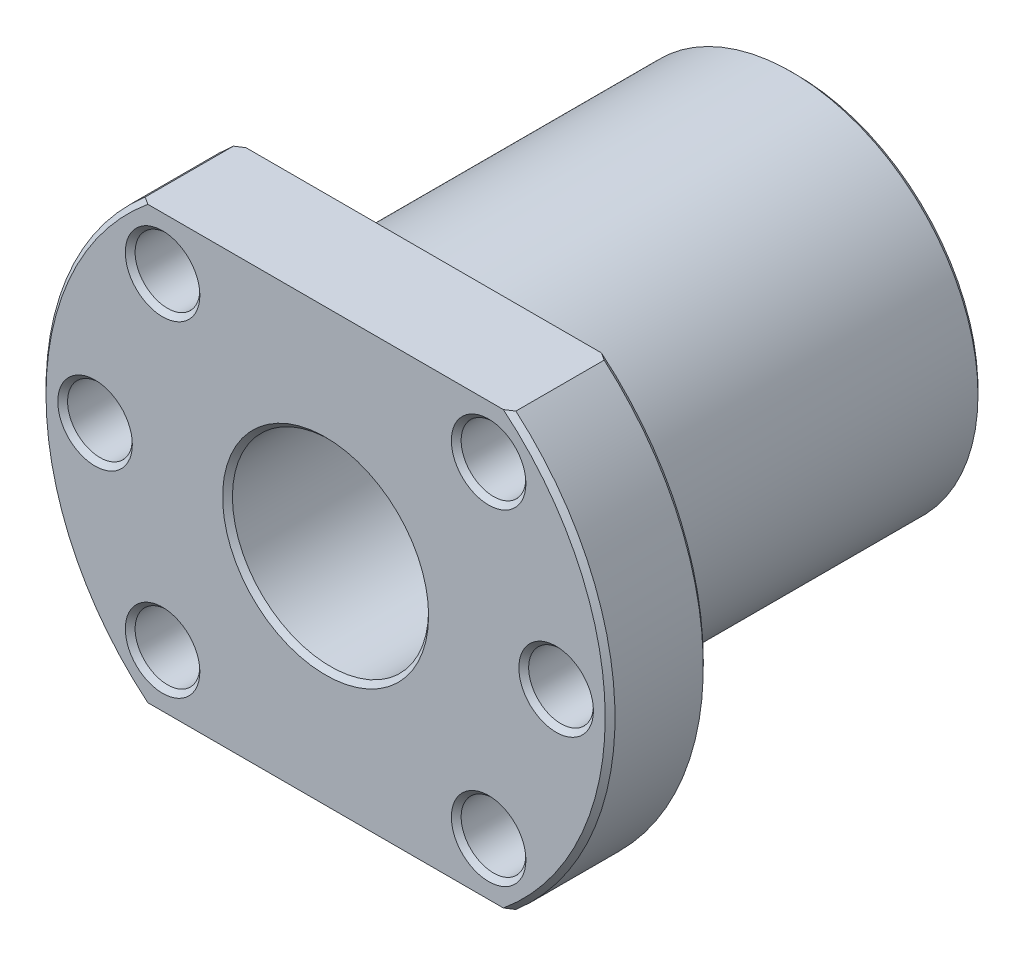
ISO-10303-21;
HEADER;
FILE_DESCRIPTION(('STEP AP214'),'2;1');
FILE_NAME('part.step','',(''),(''),'','','');
FILE_SCHEMA(('AUTOMOTIVE_DESIGN { 1 0 10303 214 1 1 1 1 }'));
ENDSEC;
DATA;
#1=APPLICATION_CONTEXT('core data for automotive mechanical design processes');
#2=APPLICATION_PROTOCOL_DEFINITION('international standard','automotive_design',2000,#1);
#3=PRODUCT_CONTEXT('',#1,'mechanical');
#4=PRODUCT('Part','Part','',(#3));
#5=PRODUCT_RELATED_PRODUCT_CATEGORY('part','',(#4));
#6=PRODUCT_DEFINITION_FORMATION('','',#4);
#7=PRODUCT_DEFINITION_CONTEXT('part definition',#1,'design');
#8=PRODUCT_DEFINITION('design','',#6,#7);
#9=PRODUCT_DEFINITION_SHAPE('','',#8);
#10=(LENGTH_UNIT() NAMED_UNIT(*) SI_UNIT(.MILLI.,.METRE.));
#11=(NAMED_UNIT(*) PLANE_ANGLE_UNIT() SI_UNIT($,.RADIAN.));
#12=(NAMED_UNIT(*) SI_UNIT($,.STERADIAN.) SOLID_ANGLE_UNIT());
#13=UNCERTAINTY_MEASURE_WITH_UNIT(LENGTH_MEASURE(1.E-05),#10,'distance_accuracy_value','');
#14=(GEOMETRIC_REPRESENTATION_CONTEXT(3) GLOBAL_UNCERTAINTY_ASSIGNED_CONTEXT((#13)) GLOBAL_UNIT_ASSIGNED_CONTEXT((#10,
#11,#12)) REPRESENTATION_CONTEXT('',''));
#15=CARTESIAN_POINT('',(0.,0.,0.));
#16=DIRECTION('',(0.,0.,1.));
#17=DIRECTION('',(1.,0.,0.));
#18=AXIS2_PLACEMENT_3D('',#15,#16,#17);
#19=CARTESIAN_POINT('',(0.,0.,0.));
#20=DIRECTION('',(0.,0.,1.));
#21=DIRECTION('',(1.,0.,0.));
#22=AXIS2_PLACEMENT_3D('',#19,#20,#21);
#23=PLANE('',#22);
#24=CARTESIAN_POINT('',(16.6170093578838,16.6170093578839,0.));
#25=DIRECTION('',(0.,0.,1.));
#26=DIRECTION('',(1.,0.,0.));
#27=AXIS2_PLACEMENT_3D('',#24,#25,#26);
#28=CIRCLE('',#27,3.8);
#29=CARTESIAN_POINT('',(20.4170093578838,16.6170093578839,0.));
#30=VERTEX_POINT('',#29);
#31=EDGE_CURVE('E312',#30,#30,#28,.T.);
#32=ORIENTED_EDGE('',*,*,#31,.T.);
#33=EDGE_LOOP('',(#32));
#34=FACE_BOUND('',#33,.T.);
#35=CARTESIAN_POINT('',(23.5,0.,0.));
#36=DIRECTION('',(0.,0.,1.));
#37=DIRECTION('',(1.,0.,0.));
#38=AXIS2_PLACEMENT_3D('',#35,#36,#37);
#39=CIRCLE('',#38,3.79999999999999);
#40=CARTESIAN_POINT('',(27.3,0.,0.));
#41=VERTEX_POINT('',#40);
#42=EDGE_CURVE('E308',#41,#41,#39,.T.);
#43=ORIENTED_EDGE('',*,*,#42,.T.);
#44=EDGE_LOOP('',(#43));
#45=FACE_BOUND('',#44,.T.);
#46=CARTESIAN_POINT('',(-16.617009357884,16.6170093578838,0.));
#47=DIRECTION('',(0.,0.,1.));
#48=DIRECTION('',(1.,0.,0.));
#49=AXIS2_PLACEMENT_3D('',#46,#47,#48);
#50=CIRCLE('',#49,3.79999999999999);
#51=CARTESIAN_POINT('',(-12.817009357884,16.6170093578838,0.));
#52=VERTEX_POINT('',#51);
#53=EDGE_CURVE('E304',#52,#52,#50,.T.);
#54=ORIENTED_EDGE('',*,*,#53,.T.);
#55=EDGE_LOOP('',(#54));
#56=FACE_BOUND('',#55,.T.);
#57=CARTESIAN_POINT('',(-23.5,0.,0.));
#58=DIRECTION('',(0.,0.,1.));
#59=DIRECTION('',(1.,0.,0.));
#60=AXIS2_PLACEMENT_3D('',#57,#58,#59);
#61=CIRCLE('',#60,3.80000000000001);
#62=CARTESIAN_POINT('',(-19.7,0.,0.));
#63=VERTEX_POINT('',#62);
#64=EDGE_CURVE('E300',#63,#63,#61,.T.);
#65=ORIENTED_EDGE('',*,*,#64,.T.);
#66=EDGE_LOOP('',(#65));
#67=FACE_BOUND('',#66,.T.);
#68=CARTESIAN_POINT('',(-16.617009357884,-16.6170093578838,0.));
#69=DIRECTION('',(0.,0.,1.));
#70=DIRECTION('',(1.,0.,0.));
#71=AXIS2_PLACEMENT_3D('',#68,#69,#70);
#72=CIRCLE('',#71,3.80000000000001);
#73=CARTESIAN_POINT('',(-12.8170093578839,-16.6170093578838,0.));
#74=VERTEX_POINT('',#73);
#75=EDGE_CURVE('E296',#74,#74,#72,.T.);
#76=ORIENTED_EDGE('',*,*,#75,.T.);
#77=EDGE_LOOP('',(#76));
#78=FACE_BOUND('',#77,.T.);
#79=CARTESIAN_POINT('',(16.6170093578841,-16.6170093578837,0.));
#80=DIRECTION('',(0.,0.,1.));
#81=DIRECTION('',(1.,0.,0.));
#82=AXIS2_PLACEMENT_3D('',#79,#80,#81);
#83=CIRCLE('',#82,3.8);
#84=CARTESIAN_POINT('',(20.4170093578841,-16.6170093578837,0.));
#85=VERTEX_POINT('',#84);
#86=EDGE_CURVE('E292',#85,#85,#83,.T.);
#87=ORIENTED_EDGE('',*,*,#86,.T.);
#88=EDGE_LOOP('',(#87));
#89=FACE_BOUND('',#88,.T.);
#90=DIRECTION('',(1.,0.,0.));
#91=VECTOR('',#90,1.);
#92=CARTESIAN_POINT('',(0.,-22.,0.));
#93=LINE('',#92,#91);
#94=CARTESIAN_POINT('',(-18.1176709319935,-22.,0.));
#95=VERTEX_POINT('',#94);
#96=CARTESIAN_POINT('',(18.1176709319935,-22.,0.));
#97=VERTEX_POINT('',#96);
#98=EDGE_CURVE('E244',#95,#97,#93,.T.);
#99=ORIENTED_EDGE('',*,*,#98,.F.);
#100=CARTESIAN_POINT('',(0.,0.,0.));
#101=DIRECTION('',(0.,0.,1.));
#102=DIRECTION('',(1.,0.,0.));
#103=AXIS2_PLACEMENT_3D('',#100,#101,#102);
#104=CIRCLE('',#103,28.5);
#105=CARTESIAN_POINT('',(-18.1176709319935,22.,0.));
#106=VERTEX_POINT('',#105);
#107=EDGE_CURVE('E235',#95,#106,#104,.F.);
#108=ORIENTED_EDGE('',*,*,#107,.T.);
#109=DIRECTION('',(-1.,0.,0.));
#110=VECTOR('',#109,1.);
#111=CARTESIAN_POINT('',(0.,22.,0.));
#112=LINE('',#111,#110);
#113=CARTESIAN_POINT('',(18.1176709319935,22.,0.));
#114=VERTEX_POINT('',#113);
#115=EDGE_CURVE('E251',#114,#106,#112,.T.);
#116=ORIENTED_EDGE('',*,*,#115,.F.);
#117=CARTESIAN_POINT('',(0.,0.,0.));
#118=DIRECTION('',(0.,0.,1.));
#119=DIRECTION('',(1.,0.,0.));
#120=AXIS2_PLACEMENT_3D('',#117,#118,#119);
#121=CIRCLE('',#120,28.5);
#122=EDGE_CURVE('E237',#114,#97,#121,.F.);
#123=ORIENTED_EDGE('',*,*,#122,.T.);
#124=EDGE_LOOP('',(#99,#108,#116,#123));
#125=FACE_BOUND('',#124,.T.);
#126=CARTESIAN_POINT('',(0.,0.,0.));
#127=DIRECTION('',(0.,0.,1.));
#128=DIRECTION('',(1.,0.,0.));
#129=AXIS2_PLACEMENT_3D('',#126,#127,#128);
#130=CIRCLE('',#129,19.);
#131=CARTESIAN_POINT('',(19.,0.,0.));
#132=VERTEX_POINT('',#131);
#133=EDGE_CURVE('E132',#132,#132,#130,.F.);
#134=ORIENTED_EDGE('',*,*,#133,.F.);
#135=EDGE_LOOP('',(#134));
#136=FACE_BOUND('',#135,.T.);
#137=ADVANCED_FACE('F41',(#34,#45,#56,#67,#78,#89,#125,#136),#23,.F.);
#138=CARTESIAN_POINT('',(0.,0.,10.));
#139=DIRECTION('',(0.,0.,1.));
#140=DIRECTION('',(1.,0.,0.));
#141=AXIS2_PLACEMENT_3D('',#138,#139,#140);
#142=PLANE('',#141);
#143=CARTESIAN_POINT('',(0.,0.,10.));
#144=DIRECTION('',(0.,0.,1.));
#145=DIRECTION('',(1.,0.,0.));
#146=AXIS2_PLACEMENT_3D('',#143,#144,#145);
#147=CIRCLE('',#146,10.5);
#148=CARTESIAN_POINT('',(10.5,0.,10.));
#149=VERTEX_POINT('',#148);
#150=EDGE_CURVE('E263',#149,#149,#147,.F.);
#151=ORIENTED_EDGE('',*,*,#150,.T.);
#152=EDGE_LOOP('',(#151));
#153=FACE_BOUND('',#152,.T.);
#154=CARTESIAN_POINT('',(23.5,0.,10.));
#155=DIRECTION('',(0.,0.,1.));
#156=DIRECTION('',(1.,0.,0.));
#157=AXIS2_PLACEMENT_3D('',#154,#155,#156);
#158=CIRCLE('',#157,3.8);
#159=CARTESIAN_POINT('',(27.3,0.,10.));
#160=VERTEX_POINT('',#159);
#161=EDGE_CURVE('E384',#160,#160,#158,.F.);
#162=ORIENTED_EDGE('',*,*,#161,.T.);
#163=EDGE_LOOP('',(#162));
#164=FACE_BOUND('',#163,.T.);
#165=CARTESIAN_POINT('',(16.6170093578841,-16.6170093578837,10.));
#166=DIRECTION('',(0.,0.,1.));
#167=DIRECTION('',(1.,0.,0.));
#168=AXIS2_PLACEMENT_3D('',#165,#166,#167);
#169=CIRCLE('',#168,3.8);
#170=CARTESIAN_POINT('',(20.4170093578841,-16.6170093578837,10.));
#171=VERTEX_POINT('',#170);
#172=EDGE_CURVE('E380',#171,#171,#169,.F.);
#173=ORIENTED_EDGE('',*,*,#172,.T.);
#174=EDGE_LOOP('',(#173));
#175=FACE_BOUND('',#174,.T.);
#176=CARTESIAN_POINT('',(-16.617009357884,-16.6170093578838,10.));
#177=DIRECTION('',(0.,0.,1.));
#178=DIRECTION('',(1.,0.,0.));
#179=AXIS2_PLACEMENT_3D('',#176,#177,#178);
#180=CIRCLE('',#179,3.8);
#181=CARTESIAN_POINT('',(-12.8170093578839,-16.6170093578838,10.));
#182=VERTEX_POINT('',#181);
#183=EDGE_CURVE('E376',#182,#182,#180,.F.);
#184=ORIENTED_EDGE('',*,*,#183,.T.);
#185=EDGE_LOOP('',(#184));
#186=FACE_BOUND('',#185,.T.);
#187=CARTESIAN_POINT('',(-23.5,0.,10.));
#188=DIRECTION('',(0.,0.,1.));
#189=DIRECTION('',(1.,0.,0.));
#190=AXIS2_PLACEMENT_3D('',#187,#188,#189);
#191=CIRCLE('',#190,3.8);
#192=CARTESIAN_POINT('',(-19.7,0.,10.));
#193=VERTEX_POINT('',#192);
#194=EDGE_CURVE('E372',#193,#193,#191,.F.);
#195=ORIENTED_EDGE('',*,*,#194,.T.);
#196=EDGE_LOOP('',(#195));
#197=FACE_BOUND('',#196,.T.);
#198=CARTESIAN_POINT('',(-16.617009357884,16.6170093578838,10.));
#199=DIRECTION('',(0.,0.,1.));
#200=DIRECTION('',(1.,0.,0.));
#201=AXIS2_PLACEMENT_3D('',#198,#199,#200);
#202=CIRCLE('',#201,3.8);
#203=CARTESIAN_POINT('',(-12.8170093578839,16.6170093578838,10.));
#204=VERTEX_POINT('',#203);
#205=EDGE_CURVE('E368',#204,#204,#202,.F.);
#206=ORIENTED_EDGE('',*,*,#205,.T.);
#207=EDGE_LOOP('',(#206));
#208=FACE_BOUND('',#207,.T.);
#209=CARTESIAN_POINT('',(16.6170093578838,16.6170093578839,10.));
#210=DIRECTION('',(0.,0.,1.));
#211=DIRECTION('',(1.,0.,0.));
#212=AXIS2_PLACEMENT_3D('',#209,#210,#211);
#213=CIRCLE('',#212,3.8);
#214=CARTESIAN_POINT('',(20.4170093578838,16.6170093578839,10.));
#215=VERTEX_POINT('',#214);
#216=EDGE_CURVE('E364',#215,#215,#213,.F.);
#217=ORIENTED_EDGE('',*,*,#216,.T.);
#218=EDGE_LOOP('',(#217));
#219=FACE_BOUND('',#218,.T.);
#220=DIRECTION('',(1.,0.,0.));
#221=VECTOR('',#220,1.);
#222=CARTESIAN_POINT('',(0.,-22.,10.));
#223=LINE('',#222,#221);
#224=CARTESIAN_POINT('',(-18.1176709319935,-22.,10.));
#225=VERTEX_POINT('',#224);
#226=CARTESIAN_POINT('',(18.1176709319935,-22.,10.));
#227=VERTEX_POINT('',#226);
#228=EDGE_CURVE('E115',#225,#227,#223,.T.);
#229=ORIENTED_EDGE('',*,*,#228,.T.);
#230=CARTESIAN_POINT('',(0.,0.,10.));
#231=DIRECTION('',(0.,0.,1.));
#232=DIRECTION('',(1.,0.,0.));
#233=AXIS2_PLACEMENT_3D('',#230,#231,#232);
#234=CIRCLE('',#233,28.5);
#235=CARTESIAN_POINT('',(18.1176709319935,22.,10.));
#236=VERTEX_POINT('',#235);
#237=EDGE_CURVE('E11',#227,#236,#234,.T.);
#238=ORIENTED_EDGE('',*,*,#237,.T.);
#239=DIRECTION('',(-1.,0.,0.));
#240=VECTOR('',#239,1.);
#241=CARTESIAN_POINT('',(0.,22.,10.));
#242=LINE('',#241,#240);
#243=CARTESIAN_POINT('',(-18.1176709319935,22.,10.));
#244=VERTEX_POINT('',#243);
#245=EDGE_CURVE('E273',#236,#244,#242,.T.);
#246=ORIENTED_EDGE('',*,*,#245,.T.);
#247=CARTESIAN_POINT('',(0.,0.,10.));
#248=DIRECTION('',(0.,0.,1.));
#249=DIRECTION('',(1.,0.,0.));
#250=AXIS2_PLACEMENT_3D('',#247,#248,#249);
#251=CIRCLE('',#250,28.5);
#252=EDGE_CURVE('E51',#244,#225,#251,.T.);
#253=ORIENTED_EDGE('',*,*,#252,.T.);
#254=EDGE_LOOP('',(#229,#238,#246,#253));
#255=FACE_BOUND('',#254,.T.);
#256=ADVANCED_FACE('F271',(#153,#164,#175,#186,#197,#208,#219,#255),#142,.T.);
#257=CARTESIAN_POINT('',(0.,0.,10.));
#258=DIRECTION('',(0.,0.,-1.));
#259=DIRECTION('',(-1.,0.,0.));
#260=AXIS2_PLACEMENT_3D('',#257,#258,#259);
#261=CYLINDRICAL_SURFACE('',#260,29.);
#262=DIRECTION('',(0.,0.,-1.));
#263=VECTOR('',#262,1.);
#264=CARTESIAN_POINT('',(-18.8944436276912,22.,10.));
#265=LINE('',#264,#263);
#266=CARTESIAN_POINT('',(-18.8944436276912,22.,9.49999999999999));
#267=VERTEX_POINT('',#266);
#268=CARTESIAN_POINT('',(-18.8944436276912,22.,0.499999999999997));
#269=VERTEX_POINT('',#268);
#270=EDGE_CURVE('E275',#267,#269,#265,.T.);
#271=ORIENTED_EDGE('',*,*,#270,.T.);
#272=CARTESIAN_POINT('',(0.,0.,0.499999999999997));
#273=DIRECTION('',(0.,0.,1.));
#274=DIRECTION('',(1.,0.,0.));
#275=AXIS2_PLACEMENT_3D('',#272,#273,#274);
#276=CIRCLE('',#275,29.);
#277=CARTESIAN_POINT('',(-18.8944436276912,-22.,0.499999999999997));
#278=VERTEX_POINT('',#277);
#279=EDGE_CURVE('E122',#269,#278,#276,.T.);
#280=ORIENTED_EDGE('',*,*,#279,.T.);
#281=DIRECTION('',(0.,0.,-1.));
#282=VECTOR('',#281,1.);
#283=CARTESIAN_POINT('',(-18.8944436276912,-22.,10.));
#284=LINE('',#283,#282);
#285=CARTESIAN_POINT('',(-18.8944436276912,-22.,9.49999999999999));
#286=VERTEX_POINT('',#285);
#287=EDGE_CURVE('E113',#286,#278,#284,.T.);
#288=ORIENTED_EDGE('',*,*,#287,.F.);
#289=CARTESIAN_POINT('',(0.,0.,9.49999999999999));
#290=DIRECTION('',(0.,0.,1.));
#291=DIRECTION('',(1.,0.,0.));
#292=AXIS2_PLACEMENT_3D('',#289,#290,#291);
#293=CIRCLE('',#292,29.);
#294=EDGE_CURVE('E128',#286,#267,#293,.F.);
#295=ORIENTED_EDGE('',*,*,#294,.T.);
#296=EDGE_LOOP('',(#271,#280,#288,#295));
#297=FACE_BOUND('',#296,.T.);
#298=ADVANCED_FACE('F127',(#297),#261,.T.);
#299=CARTESIAN_POINT('',(0.,-22.,10.));
#300=DIRECTION('',(0.,1.,0.));
#301=DIRECTION('',(0.,0.,1.));
#302=AXIS2_PLACEMENT_3D('',#299,#300,#301);
#303=PLANE('',#302);
#304=ORIENTED_EDGE('',*,*,#287,.T.);
#305=CARTESIAN_POINT('',(-18.8944436276912,-22.,0.499999999999997));
#306=CARTESIAN_POINT('',(-18.7654476909824,-22.,0.415942455408086));
#307=CARTESIAN_POINT('',(-18.6362186690729,-22.,0.332247019255507));
#308=CARTESIAN_POINT('',(-18.3772944372371,-22.,0.165580352490301));
#309=CARTESIAN_POINT('',(-18.2475992272474,-22.,0.0826091219762153));
#310=CARTESIAN_POINT('',(-18.1176709319935,-22.,0.));
#311=B_SPLINE_CURVE_WITH_KNOTS('',3,(#305,#306,#307,#308,#309,#310),.UNSPECIFIED.,.F.,.F.,(4,2,
4),(0.,0.461893489051494,0.923787040950301),.UNSPECIFIED.);
#312=EDGE_CURVE('E180',#278,#95,#311,.T.);
#313=ORIENTED_EDGE('',*,*,#312,.T.);
#314=ORIENTED_EDGE('',*,*,#98,.T.);
#315=CARTESIAN_POINT('',(18.1176709319935,-22.,0.));
#316=CARTESIAN_POINT('',(18.2475992272474,-22.,0.0826091219762149));
#317=CARTESIAN_POINT('',(18.3772944372371,-22.,0.165580352490301));
#318=CARTESIAN_POINT('',(18.6362186690729,-22.,0.332247019255507));
#319=CARTESIAN_POINT('',(18.7654476909824,-22.,0.415942455408087));
#320=CARTESIAN_POINT('',(18.8944436276912,-22.,0.499999999999998));
#321=B_SPLINE_CURVE_WITH_KNOTS('',3,(#315,#316,#317,#318,#319,#320),.UNSPECIFIED.,.F.,.F.,(4,2,
4),(0.,0.461893551898807,0.923787040950302),.UNSPECIFIED.);
#322=CARTESIAN_POINT('',(18.8944436276912,-22.,0.499999999999997));
#323=VERTEX_POINT('',#322);
#324=EDGE_CURVE('E173',#97,#323,#321,.T.);
#325=ORIENTED_EDGE('',*,*,#324,.T.);
#326=DIRECTION('',(0.,0.,-1.));
#327=VECTOR('',#326,1.);
#328=CARTESIAN_POINT('',(18.8944436276912,-22.,10.));
#329=LINE('',#328,#327);
#330=CARTESIAN_POINT('',(18.8944436276912,-22.,9.49999999999999));
#331=VERTEX_POINT('',#330);
#332=EDGE_CURVE('E133',#331,#323,#329,.T.);
#333=ORIENTED_EDGE('',*,*,#332,.F.);
#334=CARTESIAN_POINT('',(18.8944436276912,-22.,9.49999999999999));
#335=CARTESIAN_POINT('',(18.7654476909824,-22.,9.5840575445919));
#336=CARTESIAN_POINT('',(18.6362186690729,-22.,9.66775298074448));
#337=CARTESIAN_POINT('',(18.3772944372371,-22.,9.83441964750969));
#338=CARTESIAN_POINT('',(18.2475992272474,-22.,9.91739087802378));
#339=CARTESIAN_POINT('',(18.1176709319935,-22.,10.));
#340=B_SPLINE_CURVE_WITH_KNOTS('',3,(#334,#335,#336,#337,#338,#339),.UNSPECIFIED.,.F.,.F.,(4,2,
4),(0.,0.461893489051501,0.923787040950309),.UNSPECIFIED.);
#341=EDGE_CURVE('E121',#331,#227,#340,.T.);
#342=ORIENTED_EDGE('',*,*,#341,.T.);
#343=ORIENTED_EDGE('',*,*,#228,.F.);
#344=CARTESIAN_POINT('',(-18.1176709319935,-22.,10.));
#345=CARTESIAN_POINT('',(-18.2475992272474,-22.,9.91739087802378));
#346=CARTESIAN_POINT('',(-18.3772944372371,-22.,9.83441964750969));
#347=CARTESIAN_POINT('',(-18.6362186690729,-22.,9.66775298074448));
#348=CARTESIAN_POINT('',(-18.7654476909824,-22.,9.5840575445919));
#349=CARTESIAN_POINT('',(-18.8944436276912,-22.,9.49999999999999));
#350=B_SPLINE_CURVE_WITH_KNOTS('',3,(#344,#345,#346,#347,#348,#349),.UNSPECIFIED.,.F.,.F.,(4,2,
4),(0.,0.461893551898808,0.923787040950309),.UNSPECIFIED.);
#351=EDGE_CURVE('E110',#225,#286,#350,.T.);
#352=ORIENTED_EDGE('',*,*,#351,.T.);
#353=EDGE_LOOP('',(#304,#313,#314,#325,#333,#342,#343,#352));
#354=FACE_BOUND('',#353,.T.);
#355=ADVANCED_FACE('F112',(#354),#303,.F.);
#356=CARTESIAN_POINT('',(0.,0.,10.));
#357=DIRECTION('',(0.,0.,-1.));
#358=DIRECTION('',(-1.,0.,0.));
#359=AXIS2_PLACEMENT_3D('',#356,#357,#358);
#360=CYLINDRICAL_SURFACE('',#359,29.);
#361=ORIENTED_EDGE('',*,*,#332,.T.);
#362=CARTESIAN_POINT('',(0.,0.,0.499999999999997));
#363=DIRECTION('',(0.,0.,1.));
#364=DIRECTION('',(1.,0.,0.));
#365=AXIS2_PLACEMENT_3D('',#362,#363,#364);
#366=CIRCLE('',#365,29.);
#367=CARTESIAN_POINT('',(18.8944436276912,22.,0.499999999999997));
#368=VERTEX_POINT('',#367);
#369=EDGE_CURVE('E257',#323,#368,#366,.T.);
#370=ORIENTED_EDGE('',*,*,#369,.T.);
#371=DIRECTION('',(0.,0.,-1.));
#372=VECTOR('',#371,1.);
#373=CARTESIAN_POINT('',(18.8944436276912,22.,10.));
#374=LINE('',#373,#372);
#375=CARTESIAN_POINT('',(18.8944436276912,22.,9.49999999999999));
#376=VERTEX_POINT('',#375);
#377=EDGE_CURVE('E279',#376,#368,#374,.T.);
#378=ORIENTED_EDGE('',*,*,#377,.F.);
#379=CARTESIAN_POINT('',(0.,0.,9.49999999999999));
#380=DIRECTION('',(0.,0.,1.));
#381=DIRECTION('',(1.,0.,0.));
#382=AXIS2_PLACEMENT_3D('',#379,#380,#381);
#383=CIRCLE('',#382,29.);
#384=EDGE_CURVE('E255',#376,#331,#383,.F.);
#385=ORIENTED_EDGE('',*,*,#384,.T.);
#386=EDGE_LOOP('',(#361,#370,#378,#385));
#387=FACE_BOUND('',#386,.T.);
#388=ADVANCED_FACE('F166',(#387),#360,.T.);
#389=CARTESIAN_POINT('',(0.,22.,10.));
#390=DIRECTION('',(0.,-1.,0.));
#391=DIRECTION('',(0.,0.,-1.));
#392=AXIS2_PLACEMENT_3D('',#389,#390,#391);
#393=PLANE('',#392);
#394=ORIENTED_EDGE('',*,*,#115,.T.);
#395=CARTESIAN_POINT('',(-18.1176709319935,22.,0.));
#396=CARTESIAN_POINT('',(-18.2475992272474,22.,0.0826091219762149));
#397=CARTESIAN_POINT('',(-18.3772944372371,22.,0.165580352490301));
#398=CARTESIAN_POINT('',(-18.6362186690729,22.,0.332247019255507));
#399=CARTESIAN_POINT('',(-18.7654476909824,22.,0.415942455408087));
#400=CARTESIAN_POINT('',(-18.8944436276912,22.,0.499999999999998));
#401=B_SPLINE_CURVE_WITH_KNOTS('',3,(#395,#396,#397,#398,#399,#400),.UNSPECIFIED.,.F.,.F.,(4,2,
4),(0.,0.461893551898807,0.923787040950302),.UNSPECIFIED.);
#402=EDGE_CURVE('E209',#106,#269,#401,.T.);
#403=ORIENTED_EDGE('',*,*,#402,.T.);
#404=ORIENTED_EDGE('',*,*,#270,.F.);
#405=CARTESIAN_POINT('',(-18.8944436276912,22.,9.49999999999999));
#406=CARTESIAN_POINT('',(-18.7654476909824,22.,9.5840575445919));
#407=CARTESIAN_POINT('',(-18.6362186690729,22.,9.66775298074448));
#408=CARTESIAN_POINT('',(-18.3772944372371,22.,9.83441964750969));
#409=CARTESIAN_POINT('',(-18.2475992272474,22.,9.91739087802378));
#410=CARTESIAN_POINT('',(-18.1176709319935,22.,10.));
#411=B_SPLINE_CURVE_WITH_KNOTS('',3,(#405,#406,#407,#408,#409,#410),.UNSPECIFIED.,.F.,.F.,(4,2,
4),(0.,0.461893489051501,0.923787040950309),.UNSPECIFIED.);
#412=EDGE_CURVE('E137',#267,#244,#411,.T.);
#413=ORIENTED_EDGE('',*,*,#412,.T.);
#414=ORIENTED_EDGE('',*,*,#245,.F.);
#415=CARTESIAN_POINT('',(18.1176709319935,22.,10.));
#416=CARTESIAN_POINT('',(18.2475992272474,22.,9.91739087802378));
#417=CARTESIAN_POINT('',(18.3772944372371,22.,9.83441964750969));
#418=CARTESIAN_POINT('',(18.6362186690729,22.,9.66775298074448));
#419=CARTESIAN_POINT('',(18.7654476909824,22.,9.5840575445919));
#420=CARTESIAN_POINT('',(18.8944436276912,22.,9.49999999999999));
#421=B_SPLINE_CURVE_WITH_KNOTS('',3,(#415,#416,#417,#418,#419,#420),.UNSPECIFIED.,.F.,.F.,(4,2,
4),(0.,0.461893551898808,0.923787040950309),.UNSPECIFIED.);
#422=EDGE_CURVE('E66',#236,#376,#421,.T.);
#423=ORIENTED_EDGE('',*,*,#422,.T.);
#424=ORIENTED_EDGE('',*,*,#377,.T.);
#425=CARTESIAN_POINT('',(18.8944436276912,22.,0.499999999999997));
#426=CARTESIAN_POINT('',(18.7654476909824,22.,0.415942455408087));
#427=CARTESIAN_POINT('',(18.6362186690729,22.,0.332247019255508));
#428=CARTESIAN_POINT('',(18.3772944372371,22.,0.165580352490301));
#429=CARTESIAN_POINT('',(18.2475992272474,22.,0.0826091219762145));
#430=CARTESIAN_POINT('',(18.1176709319935,22.,0.));
#431=B_SPLINE_CURVE_WITH_KNOTS('',3,(#425,#426,#427,#428,#429,#430),.UNSPECIFIED.,.F.,.F.,(4,2,
4),(0.,0.461893489051497,0.923787040950303),.UNSPECIFIED.);
#432=EDGE_CURVE('E58',#368,#114,#431,.T.);
#433=ORIENTED_EDGE('',*,*,#432,.T.);
#434=EDGE_LOOP('',(#394,#403,#404,#413,#414,#423,#424,#433));
#435=FACE_BOUND('',#434,.T.);
#436=ADVANCED_FACE('F220',(#435),#393,.F.);
#437=CARTESIAN_POINT('',(0.,0.,10.));
#438=DIRECTION('',(0.,0.,-1.));
#439=DIRECTION('',(-1.,0.,0.));
#440=AXIS2_PLACEMENT_3D('',#437,#438,#439);
#441=CYLINDRICAL_SURFACE('',#440,10.);
#442=CARTESIAN_POINT('',(0.,0.,-37.5));
#443=DIRECTION('',(0.,0.,-1.));
#444=DIRECTION('',(-1.,0.,0.));
#445=AXIS2_PLACEMENT_3D('',#442,#443,#444);
#446=CIRCLE('',#445,10.);
#447=CARTESIAN_POINT('',(-10.,0.,-37.5));
#448=VERTEX_POINT('',#447);
#449=EDGE_CURVE('E139',#448,#448,#446,.T.);
#450=ORIENTED_EDGE('',*,*,#449,.T.);
#451=EDGE_LOOP('',(#450));
#452=FACE_BOUND('',#451,.T.);
#453=CARTESIAN_POINT('',(0.,0.,9.49999999999999));
#454=DIRECTION('',(0.,0.,1.));
#455=DIRECTION('',(1.,0.,0.));
#456=AXIS2_PLACEMENT_3D('',#453,#454,#455);
#457=CIRCLE('',#456,10.);
#458=CARTESIAN_POINT('',(10.,0.,9.49999999999999));
#459=VERTEX_POINT('',#458);
#460=EDGE_CURVE('E145',#459,#459,#457,.T.);
#461=ORIENTED_EDGE('',*,*,#460,.T.);
#462=EDGE_LOOP('',(#461));
#463=FACE_BOUND('',#462,.T.);
#464=ADVANCED_FACE('F224',(#452,#463),#441,.F.);
#465=CARTESIAN_POINT('',(-16.617009357884,16.6170093578838,10.));
#466=DIRECTION('',(0.,0.,-1.));
#467=DIRECTION('',(-1.,0.,0.));
#468=AXIS2_PLACEMENT_3D('',#465,#466,#467);
#469=CYLINDRICAL_SURFACE('',#468,3.3);
#470=CARTESIAN_POINT('',(-16.617009357884,16.6170093578838,0.499999999999997));
#471=DIRECTION('',(0.,0.,1.));
#472=DIRECTION('',(1.,0.,0.));
#473=AXIS2_PLACEMENT_3D('',#470,#471,#472);
#474=CIRCLE('',#473,3.3);
#475=CARTESIAN_POINT('',(-13.317009357884,16.6170093578838,0.499999999999997));
#476=VERTEX_POINT('',#475);
#477=EDGE_CURVE('E336',#476,#476,#474,.F.);
#478=ORIENTED_EDGE('',*,*,#477,.T.);
#479=EDGE_LOOP('',(#478));
#480=FACE_BOUND('',#479,.T.);
#481=CARTESIAN_POINT('',(-16.617009357884,16.6170093578838,9.5));
#482=DIRECTION('',(0.,0.,1.));
#483=DIRECTION('',(1.,0.,0.));
#484=AXIS2_PLACEMENT_3D('',#481,#482,#483);
#485=CIRCLE('',#484,3.3);
#486=CARTESIAN_POINT('',(-13.317009357884,16.6170093578838,9.5));
#487=VERTEX_POINT('',#486);
#488=EDGE_CURVE('E332',#487,#487,#485,.T.);
#489=ORIENTED_EDGE('',*,*,#488,.T.);
#490=EDGE_LOOP('',(#489));
#491=FACE_BOUND('',#490,.T.);
#492=ADVANCED_FACE('F508',(#480,#491),#469,.F.);
#493=CARTESIAN_POINT('',(-23.5,0.,10.));
#494=DIRECTION('',(0.,0.,-1.));
#495=DIRECTION('',(-1.,0.,0.));
#496=AXIS2_PLACEMENT_3D('',#493,#494,#495);
#497=CYLINDRICAL_SURFACE('',#496,3.3);
#498=CARTESIAN_POINT('',(-23.5,0.,0.500000000000018));
#499=DIRECTION('',(0.,0.,1.));
#500=DIRECTION('',(1.,0.,0.));
#501=AXIS2_PLACEMENT_3D('',#498,#499,#500);
#502=CIRCLE('',#501,3.3);
#503=CARTESIAN_POINT('',(-20.2,0.,0.500000000000018));
#504=VERTEX_POINT('',#503);
#505=EDGE_CURVE('E344',#504,#504,#502,.F.);
#506=ORIENTED_EDGE('',*,*,#505,.T.);
#507=EDGE_LOOP('',(#506));
#508=FACE_BOUND('',#507,.T.);
#509=CARTESIAN_POINT('',(-23.5,0.,9.5));
#510=DIRECTION('',(0.,0.,1.));
#511=DIRECTION('',(1.,0.,0.));
#512=AXIS2_PLACEMENT_3D('',#509,#510,#511);
#513=CIRCLE('',#512,3.3);
#514=CARTESIAN_POINT('',(-20.2,0.,9.5));
#515=VERTEX_POINT('',#514);
#516=EDGE_CURVE('E340',#515,#515,#513,.T.);
#517=ORIENTED_EDGE('',*,*,#516,.T.);
#518=EDGE_LOOP('',(#517));
#519=FACE_BOUND('',#518,.T.);
#520=ADVANCED_FACE('F513',(#508,#519),#497,.F.);
#521=CARTESIAN_POINT('',(-16.617009357884,-16.6170093578838,10.));
#522=DIRECTION('',(0.,0.,-1.));
#523=DIRECTION('',(-1.,0.,0.));
#524=AXIS2_PLACEMENT_3D('',#521,#522,#523);
#525=CYLINDRICAL_SURFACE('',#524,3.3);
#526=CARTESIAN_POINT('',(-16.617009357884,-16.6170093578838,0.500000000000016));
#527=DIRECTION('',(0.,0.,1.));
#528=DIRECTION('',(1.,0.,0.));
#529=AXIS2_PLACEMENT_3D('',#526,#527,#528);
#530=CIRCLE('',#529,3.3);
#531=CARTESIAN_POINT('',(-13.3170093578839,-16.6170093578838,0.500000000000016));
#532=VERTEX_POINT('',#531);
#533=EDGE_CURVE('E352',#532,#532,#530,.F.);
#534=ORIENTED_EDGE('',*,*,#533,.T.);
#535=EDGE_LOOP('',(#534));
#536=FACE_BOUND('',#535,.T.);
#537=CARTESIAN_POINT('',(-16.617009357884,-16.6170093578838,9.5));
#538=DIRECTION('',(0.,0.,1.));
#539=DIRECTION('',(1.,0.,0.));
#540=AXIS2_PLACEMENT_3D('',#537,#538,#539);
#541=CIRCLE('',#540,3.3);
#542=CARTESIAN_POINT('',(-13.3170093578839,-16.6170093578838,9.5));
#543=VERTEX_POINT('',#542);
#544=EDGE_CURVE('E348',#543,#543,#541,.T.);
#545=ORIENTED_EDGE('',*,*,#544,.T.);
#546=EDGE_LOOP('',(#545));
#547=FACE_BOUND('',#546,.T.);
#548=ADVANCED_FACE('F519',(#536,#547),#525,.F.);
#549=CARTESIAN_POINT('',(16.6170093578841,-16.6170093578837,10.));
#550=DIRECTION('',(0.,0.,-1.));
#551=DIRECTION('',(-1.,0.,0.));
#552=AXIS2_PLACEMENT_3D('',#549,#550,#551);
#553=CYLINDRICAL_SURFACE('',#552,3.3);
#554=CARTESIAN_POINT('',(16.6170093578841,-16.6170093578837,0.499999999999992));
#555=DIRECTION('',(0.,0.,1.));
#556=DIRECTION('',(1.,0.,0.));
#557=AXIS2_PLACEMENT_3D('',#554,#555,#556);
#558=CIRCLE('',#557,3.3);
#559=CARTESIAN_POINT('',(19.9170093578841,-16.6170093578837,0.499999999999992));
#560=VERTEX_POINT('',#559);
#561=EDGE_CURVE('E360',#560,#560,#558,.F.);
#562=ORIENTED_EDGE('',*,*,#561,.T.);
#563=EDGE_LOOP('',(#562));
#564=FACE_BOUND('',#563,.T.);
#565=CARTESIAN_POINT('',(16.6170093578841,-16.6170093578837,9.5));
#566=DIRECTION('',(0.,0.,1.));
#567=DIRECTION('',(1.,0.,0.));
#568=AXIS2_PLACEMENT_3D('',#565,#566,#567);
#569=CIRCLE('',#568,3.3);
#570=CARTESIAN_POINT('',(19.9170093578841,-16.6170093578837,9.5));
#571=VERTEX_POINT('',#570);
#572=EDGE_CURVE('E356',#571,#571,#569,.T.);
#573=ORIENTED_EDGE('',*,*,#572,.T.);
#574=EDGE_LOOP('',(#573));
#575=FACE_BOUND('',#574,.T.);
#576=ADVANCED_FACE('F523',(#564,#575),#553,.F.);
#577=CARTESIAN_POINT('',(23.5,0.,10.));
#578=DIRECTION('',(0.,0.,-1.));
#579=DIRECTION('',(-1.,0.,0.));
#580=AXIS2_PLACEMENT_3D('',#577,#578,#579);
#581=CYLINDRICAL_SURFACE('',#580,3.3);
#582=CARTESIAN_POINT('',(23.5,0.,0.499999999999997));
#583=DIRECTION('',(0.,0.,1.));
#584=DIRECTION('',(1.,0.,0.));
#585=AXIS2_PLACEMENT_3D('',#582,#583,#584);
#586=CIRCLE('',#585,3.3);
#587=CARTESIAN_POINT('',(26.8,0.,0.499999999999997));
#588=VERTEX_POINT('',#587);
#589=EDGE_CURVE('E328',#588,#588,#586,.F.);
#590=ORIENTED_EDGE('',*,*,#589,.T.);
#591=EDGE_LOOP('',(#590));
#592=FACE_BOUND('',#591,.T.);
#593=CARTESIAN_POINT('',(23.5,0.,9.5));
#594=DIRECTION('',(0.,0.,1.));
#595=DIRECTION('',(1.,0.,0.));
#596=AXIS2_PLACEMENT_3D('',#593,#594,#595);
#597=CIRCLE('',#596,3.3);
#598=CARTESIAN_POINT('',(26.8,0.,9.5));
#599=VERTEX_POINT('',#598);
#600=EDGE_CURVE('E324',#599,#599,#597,.T.);
#601=ORIENTED_EDGE('',*,*,#600,.T.);
#602=EDGE_LOOP('',(#601));
#603=FACE_BOUND('',#602,.T.);
#604=ADVANCED_FACE('F527',(#592,#603),#581,.F.);
#605=CARTESIAN_POINT('',(16.6170093578838,16.6170093578839,10.));
#606=DIRECTION('',(0.,0.,-1.));
#607=DIRECTION('',(-1.,0.,0.));
#608=AXIS2_PLACEMENT_3D('',#605,#606,#607);
#609=CYLINDRICAL_SURFACE('',#608,3.3);
#610=CARTESIAN_POINT('',(16.6170093578838,16.6170093578839,0.499999999999992));
#611=DIRECTION('',(0.,0.,1.));
#612=DIRECTION('',(1.,0.,0.));
#613=AXIS2_PLACEMENT_3D('',#610,#611,#612);
#614=CIRCLE('',#613,3.3);
#615=CARTESIAN_POINT('',(19.9170093578838,16.6170093578839,0.499999999999992));
#616=VERTEX_POINT('',#615);
#617=EDGE_CURVE('E320',#616,#616,#614,.F.);
#618=ORIENTED_EDGE('',*,*,#617,.T.);
#619=EDGE_LOOP('',(#618));
#620=FACE_BOUND('',#619,.T.);
#621=CARTESIAN_POINT('',(16.6170093578838,16.6170093578839,9.5));
#622=DIRECTION('',(0.,0.,1.));
#623=DIRECTION('',(1.,0.,0.));
#624=AXIS2_PLACEMENT_3D('',#621,#622,#623);
#625=CIRCLE('',#624,3.3);
#626=CARTESIAN_POINT('',(19.9170093578838,16.6170093578839,9.5));
#627=VERTEX_POINT('',#626);
#628=EDGE_CURVE('E316',#627,#627,#625,.T.);
#629=ORIENTED_EDGE('',*,*,#628,.T.);
#630=EDGE_LOOP('',(#629));
#631=FACE_BOUND('',#630,.T.);
#632=ADVANCED_FACE('F531',(#620,#631),#609,.F.);
#633=CARTESIAN_POINT('',(0.,0.,-38.));
#634=DIRECTION('',(0.,0.,-1.));
#635=DIRECTION('',(-1.,0.,0.));
#636=AXIS2_PLACEMENT_3D('',#633,#634,#635);
#637=PLANE('',#636);
#638=CARTESIAN_POINT('',(0.,0.,-38.));
#639=DIRECTION('',(0.,0.,-1.));
#640=DIRECTION('',(-1.,0.,0.));
#641=AXIS2_PLACEMENT_3D('',#638,#639,#640);
#642=CIRCLE('',#641,18.5);
#643=CARTESIAN_POINT('',(-18.5,0.,-38.));
#644=VERTEX_POINT('',#643);
#645=EDGE_CURVE('E392',#644,#644,#642,.T.);
#646=ORIENTED_EDGE('',*,*,#645,.T.);
#647=EDGE_LOOP('',(#646));
#648=FACE_BOUND('',#647,.T.);
#649=CARTESIAN_POINT('',(0.,0.,-38.));
#650=DIRECTION('',(0.,0.,-1.));
#651=DIRECTION('',(-1.,0.,0.));
#652=AXIS2_PLACEMENT_3D('',#649,#650,#651);
#653=CIRCLE('',#652,10.5);
#654=CARTESIAN_POINT('',(-10.5,0.,-38.));
#655=VERTEX_POINT('',#654);
#656=EDGE_CURVE('E388',#655,#655,#653,.F.);
#657=ORIENTED_EDGE('',*,*,#656,.T.);
#658=EDGE_LOOP('',(#657));
#659=FACE_BOUND('',#658,.T.);
#660=ADVANCED_FACE('F535',(#648,#659),#637,.T.);
#661=CARTESIAN_POINT('',(0.,0.,-38.));
#662=DIRECTION('',(0.,0.,1.));
#663=DIRECTION('',(1.,0.,0.));
#664=AXIS2_PLACEMENT_3D('',#661,#662,#663);
#665=CYLINDRICAL_SURFACE('',#664,19.);
#666=CARTESIAN_POINT('',(0.,0.,-37.5));
#667=DIRECTION('',(0.,0.,-1.));
#668=DIRECTION('',(-1.,0.,0.));
#669=AXIS2_PLACEMENT_3D('',#666,#667,#668);
#670=CIRCLE('',#669,19.);
#671=CARTESIAN_POINT('',(-19.,0.,-37.5));
#672=VERTEX_POINT('',#671);
#673=EDGE_CURVE('E396',#672,#672,#670,.F.);
#674=ORIENTED_EDGE('',*,*,#673,.T.);
#675=EDGE_LOOP('',(#674));
#676=FACE_BOUND('',#675,.T.);
#677=ORIENTED_EDGE('',*,*,#133,.T.);
#678=EDGE_LOOP('',(#677));
#679=FACE_BOUND('',#678,.T.);
#680=ADVANCED_FACE('F537',(#676,#679),#665,.T.);
#681=CARTESIAN_POINT('',(16.6170093578838,16.6170093578839,0.));
#682=DIRECTION('',(0.,0.,-1.));
#683=DIRECTION('',(-1.,0.,0.));
#684=AXIS2_PLACEMENT_3D('',#681,#682,#683);
#685=CONICAL_SURFACE('',#684,3.8,0.785398163397453);
#686=ORIENTED_EDGE('',*,*,#617,.F.);
#687=EDGE_LOOP('',(#686));
#688=FACE_BOUND('',#687,.T.);
#689=ORIENTED_EDGE('',*,*,#31,.F.);
#690=EDGE_LOOP('',(#689));
#691=FACE_BOUND('',#690,.T.);
#692=ADVANCED_FACE('F540',(#688,#691),#685,.F.);
#693=CARTESIAN_POINT('',(23.5,0.,0.));
#694=DIRECTION('',(0.,0.,-1.));
#695=DIRECTION('',(-1.,0.,0.));
#696=AXIS2_PLACEMENT_3D('',#693,#694,#695);
#697=CONICAL_SURFACE('',#696,3.79999999999999,0.785398163397441);
#698=ORIENTED_EDGE('',*,*,#589,.F.);
#699=EDGE_LOOP('',(#698));
#700=FACE_BOUND('',#699,.T.);
#701=ORIENTED_EDGE('',*,*,#42,.F.);
#702=EDGE_LOOP('',(#701));
#703=FACE_BOUND('',#702,.T.);
#704=ADVANCED_FACE('F562',(#700,#703),#697,.F.);
#705=CARTESIAN_POINT('',(-16.617009357884,16.6170093578838,0.));
#706=DIRECTION('',(0.,0.,-1.));
#707=DIRECTION('',(-1.,0.,0.));
#708=AXIS2_PLACEMENT_3D('',#705,#706,#707);
#709=CONICAL_SURFACE('',#708,3.79999999999999,0.785398163397441);
#710=ORIENTED_EDGE('',*,*,#477,.F.);
#711=EDGE_LOOP('',(#710));
#712=FACE_BOUND('',#711,.T.);
#713=ORIENTED_EDGE('',*,*,#53,.F.);
#714=EDGE_LOOP('',(#713));
#715=FACE_BOUND('',#714,.T.);
#716=ADVANCED_FACE('F569',(#712,#715),#709,.F.);
#717=CARTESIAN_POINT('',(-23.5,0.,0.));
#718=DIRECTION('',(0.,0.,-1.));
#719=DIRECTION('',(-1.,0.,0.));
#720=AXIS2_PLACEMENT_3D('',#717,#718,#719);
#721=CONICAL_SURFACE('',#720,3.80000000000001,0.785398163397441);
#722=ORIENTED_EDGE('',*,*,#505,.F.);
#723=EDGE_LOOP('',(#722));
#724=FACE_BOUND('',#723,.T.);
#725=ORIENTED_EDGE('',*,*,#64,.F.);
#726=EDGE_LOOP('',(#725));
#727=FACE_BOUND('',#726,.T.);
#728=ADVANCED_FACE('F441',(#724,#727),#721,.F.);
#729=CARTESIAN_POINT('',(-16.617009357884,-16.6170093578838,0.));
#730=DIRECTION('',(0.,0.,-1.));
#731=DIRECTION('',(-1.,0.,0.));
#732=AXIS2_PLACEMENT_3D('',#729,#730,#731);
#733=CONICAL_SURFACE('',#732,3.80000000000001,0.785398163397438);
#734=ORIENTED_EDGE('',*,*,#533,.F.);
#735=EDGE_LOOP('',(#734));
#736=FACE_BOUND('',#735,.T.);
#737=ORIENTED_EDGE('',*,*,#75,.F.);
#738=EDGE_LOOP('',(#737));
#739=FACE_BOUND('',#738,.T.);
#740=ADVANCED_FACE('F431',(#736,#739),#733,.F.);
#741=CARTESIAN_POINT('',(16.6170093578841,-16.6170093578837,0.));
#742=DIRECTION('',(0.,0.,-1.));
#743=DIRECTION('',(-1.,0.,0.));
#744=AXIS2_PLACEMENT_3D('',#741,#742,#743);
#745=CONICAL_SURFACE('',#744,3.8,0.785398163397453);
#746=ORIENTED_EDGE('',*,*,#561,.F.);
#747=EDGE_LOOP('',(#746));
#748=FACE_BOUND('',#747,.T.);
#749=ORIENTED_EDGE('',*,*,#86,.F.);
#750=EDGE_LOOP('',(#749));
#751=FACE_BOUND('',#750,.T.);
#752=ADVANCED_FACE('F428',(#748,#751),#745,.F.);
#753=CARTESIAN_POINT('',(23.5,0.,9.5));
#754=DIRECTION('',(0.,0.,1.));
#755=DIRECTION('',(1.,0.,0.));
#756=AXIS2_PLACEMENT_3D('',#753,#754,#755);
#757=CONICAL_SURFACE('',#756,3.3,0.78539816339745);
#758=ORIENTED_EDGE('',*,*,#161,.F.);
#759=EDGE_LOOP('',(#758));
#760=FACE_BOUND('',#759,.T.);
#761=ORIENTED_EDGE('',*,*,#600,.F.);
#762=EDGE_LOOP('',(#761));
#763=FACE_BOUND('',#762,.T.);
#764=ADVANCED_FACE('F430',(#760,#763),#757,.F.);
#765=CARTESIAN_POINT('',(16.6170093578841,-16.6170093578837,9.5));
#766=DIRECTION('',(0.,0.,1.));
#767=DIRECTION('',(1.,0.,0.));
#768=AXIS2_PLACEMENT_3D('',#765,#766,#767);
#769=CONICAL_SURFACE('',#768,3.3,0.78539816339745);
#770=ORIENTED_EDGE('',*,*,#172,.F.);
#771=EDGE_LOOP('',(#770));
#772=FACE_BOUND('',#771,.T.);
#773=ORIENTED_EDGE('',*,*,#572,.F.);
#774=EDGE_LOOP('',(#773));
#775=FACE_BOUND('',#774,.T.);
#776=ADVANCED_FACE('F438',(#772,#775),#769,.F.);
#777=CARTESIAN_POINT('',(-16.617009357884,-16.6170093578838,9.5));
#778=DIRECTION('',(0.,0.,1.));
#779=DIRECTION('',(1.,0.,0.));
#780=AXIS2_PLACEMENT_3D('',#777,#778,#779);
#781=CONICAL_SURFACE('',#780,3.3,0.785398163397447);
#782=ORIENTED_EDGE('',*,*,#183,.F.);
#783=EDGE_LOOP('',(#782));
#784=FACE_BOUND('',#783,.T.);
#785=ORIENTED_EDGE('',*,*,#544,.F.);
#786=EDGE_LOOP('',(#785));
#787=FACE_BOUND('',#786,.T.);
#788=ADVANCED_FACE('F460',(#784,#787),#781,.F.);
#789=CARTESIAN_POINT('',(-23.5,0.,9.5));
#790=DIRECTION('',(0.,0.,1.));
#791=DIRECTION('',(1.,0.,0.));
#792=AXIS2_PLACEMENT_3D('',#789,#790,#791);
#793=CONICAL_SURFACE('',#792,3.3,0.78539816339745);
#794=ORIENTED_EDGE('',*,*,#194,.F.);
#795=EDGE_LOOP('',(#794));
#796=FACE_BOUND('',#795,.T.);
#797=ORIENTED_EDGE('',*,*,#516,.F.);
#798=EDGE_LOOP('',(#797));
#799=FACE_BOUND('',#798,.T.);
#800=ADVANCED_FACE('F467',(#796,#799),#793,.F.);
#801=CARTESIAN_POINT('',(-16.617009357884,16.6170093578838,9.5));
#802=DIRECTION('',(0.,0.,1.));
#803=DIRECTION('',(1.,0.,0.));
#804=AXIS2_PLACEMENT_3D('',#801,#802,#803);
#805=CONICAL_SURFACE('',#804,3.3,0.78539816339745);
#806=ORIENTED_EDGE('',*,*,#205,.F.);
#807=EDGE_LOOP('',(#806));
#808=FACE_BOUND('',#807,.T.);
#809=ORIENTED_EDGE('',*,*,#488,.F.);
#810=EDGE_LOOP('',(#809));
#811=FACE_BOUND('',#810,.T.);
#812=ADVANCED_FACE('F474',(#808,#811),#805,.F.);
#813=CARTESIAN_POINT('',(16.6170093578838,16.6170093578839,9.5));
#814=DIRECTION('',(0.,0.,1.));
#815=DIRECTION('',(1.,0.,0.));
#816=AXIS2_PLACEMENT_3D('',#813,#814,#815);
#817=CONICAL_SURFACE('',#816,3.3,0.78539816339745);
#818=ORIENTED_EDGE('',*,*,#216,.F.);
#819=EDGE_LOOP('',(#818));
#820=FACE_BOUND('',#819,.T.);
#821=ORIENTED_EDGE('',*,*,#628,.F.);
#822=EDGE_LOOP('',(#821));
#823=FACE_BOUND('',#822,.T.);
#824=ADVANCED_FACE('F481',(#820,#823),#817,.F.);
#825=CARTESIAN_POINT('',(0.,0.,-38.));
#826=DIRECTION('',(0.,0.,1.));
#827=DIRECTION('',(1.,0.,0.));
#828=AXIS2_PLACEMENT_3D('',#825,#826,#827);
#829=CONICAL_SURFACE('',#828,18.5,0.785398163397438);
#830=ORIENTED_EDGE('',*,*,#673,.F.);
#831=EDGE_LOOP('',(#830));
#832=FACE_BOUND('',#831,.T.);
#833=ORIENTED_EDGE('',*,*,#645,.F.);
#834=EDGE_LOOP('',(#833));
#835=FACE_BOUND('',#834,.T.);
#836=ADVANCED_FACE('F488',(#832,#835),#829,.T.);
#837=CARTESIAN_POINT('',(0.,0.,-37.5));
#838=DIRECTION('',(0.,0.,-1.));
#839=DIRECTION('',(-1.,0.,0.));
#840=AXIS2_PLACEMENT_3D('',#837,#838,#839);
#841=CONICAL_SURFACE('',#840,10.,0.78539816339745);
#842=ORIENTED_EDGE('',*,*,#656,.F.);
#843=EDGE_LOOP('',(#842));
#844=FACE_BOUND('',#843,.T.);
#845=ORIENTED_EDGE('',*,*,#449,.F.);
#846=EDGE_LOOP('',(#845));
#847=FACE_BOUND('',#846,.T.);
#848=ADVANCED_FACE('F494',(#844,#847),#841,.F.);
#849=CARTESIAN_POINT('',(0.,0.,0.499999999999997));
#850=DIRECTION('',(0.,0.,1.));
#851=DIRECTION('',(1.,0.,0.));
#852=AXIS2_PLACEMENT_3D('',#849,#850,#851);
#853=CONICAL_SURFACE('',#852,29.,0.785398163397445);
#854=ORIENTED_EDGE('',*,*,#402,.F.);
#855=ORIENTED_EDGE('',*,*,#107,.F.);
#856=ORIENTED_EDGE('',*,*,#312,.F.);
#857=ORIENTED_EDGE('',*,*,#279,.F.);
#858=EDGE_LOOP('',(#854,#855,#856,#857));
#859=FACE_BOUND('',#858,.T.);
#860=ADVANCED_FACE('F196',(#859),#853,.T.);
#861=CARTESIAN_POINT('',(0.,0.,0.499999999999997));
#862=DIRECTION('',(0.,0.,1.));
#863=DIRECTION('',(1.,0.,0.));
#864=AXIS2_PLACEMENT_3D('',#861,#862,#863);
#865=CONICAL_SURFACE('',#864,29.,0.785398163397445);
#866=ORIENTED_EDGE('',*,*,#324,.F.);
#867=ORIENTED_EDGE('',*,*,#122,.F.);
#868=ORIENTED_EDGE('',*,*,#432,.F.);
#869=ORIENTED_EDGE('',*,*,#369,.F.);
#870=EDGE_LOOP('',(#866,#867,#868,#869));
#871=FACE_BOUND('',#870,.T.);
#872=ADVANCED_FACE('F188',(#871),#865,.T.);
#873=CARTESIAN_POINT('',(0.,0.,10.));
#874=DIRECTION('',(0.,0.,-1.));
#875=DIRECTION('',(-1.,0.,0.));
#876=AXIS2_PLACEMENT_3D('',#873,#874,#875);
#877=CONICAL_SURFACE('',#876,28.5,0.785398163397431);
#878=ORIENTED_EDGE('',*,*,#341,.F.);
#879=ORIENTED_EDGE('',*,*,#384,.F.);
#880=ORIENTED_EDGE('',*,*,#422,.F.);
#881=ORIENTED_EDGE('',*,*,#237,.F.);
#882=EDGE_LOOP('',(#878,#879,#880,#881));
#883=FACE_BOUND('',#882,.T.);
#884=ADVANCED_FACE('F195',(#883),#877,.T.);
#885=CARTESIAN_POINT('',(0.,0.,10.));
#886=DIRECTION('',(0.,0.,-1.));
#887=DIRECTION('',(-1.,0.,0.));
#888=AXIS2_PLACEMENT_3D('',#885,#886,#887);
#889=CONICAL_SURFACE('',#888,28.5,0.785398163397431);
#890=ORIENTED_EDGE('',*,*,#412,.F.);
#891=ORIENTED_EDGE('',*,*,#294,.F.);
#892=ORIENTED_EDGE('',*,*,#351,.F.);
#893=ORIENTED_EDGE('',*,*,#252,.F.);
#894=EDGE_LOOP('',(#890,#891,#892,#893));
#895=FACE_BOUND('',#894,.T.);
#896=ADVANCED_FACE('F136',(#895),#889,.T.);
#897=CARTESIAN_POINT('',(0.,0.,9.49999999999999));
#898=DIRECTION('',(0.,0.,1.));
#899=DIRECTION('',(1.,0.,0.));
#900=AXIS2_PLACEMENT_3D('',#897,#898,#899);
#901=CONICAL_SURFACE('',#900,10.,0.785398163397448);
#902=ORIENTED_EDGE('',*,*,#150,.F.);
#903=EDGE_LOOP('',(#902));
#904=FACE_BOUND('',#903,.T.);
#905=ORIENTED_EDGE('',*,*,#460,.F.);
#906=EDGE_LOOP('',(#905));
#907=FACE_BOUND('',#906,.T.);
#908=ADVANCED_FACE('F44',(#904,#907),#901,.F.);
#909=CLOSED_SHELL('',(#137,#256,#298,#355,#388,#436,#464,#492,#520,#548,#576,#604,#632,#660,
#680,#692,#704,#716,#728,#740,#752,#764,#776,#788,#800,#812,#824,#836,#848,#860,#872,#884,#896,#908));
#910=MANIFOLD_SOLID_BREP('B2',#909);
#911=ADVANCED_BREP_SHAPE_REPRESENTATION('',(#18,#910),#14);
#912=SHAPE_DEFINITION_REPRESENTATION(#9,#911);
ENDSEC;
END-ISO-10303-21;
